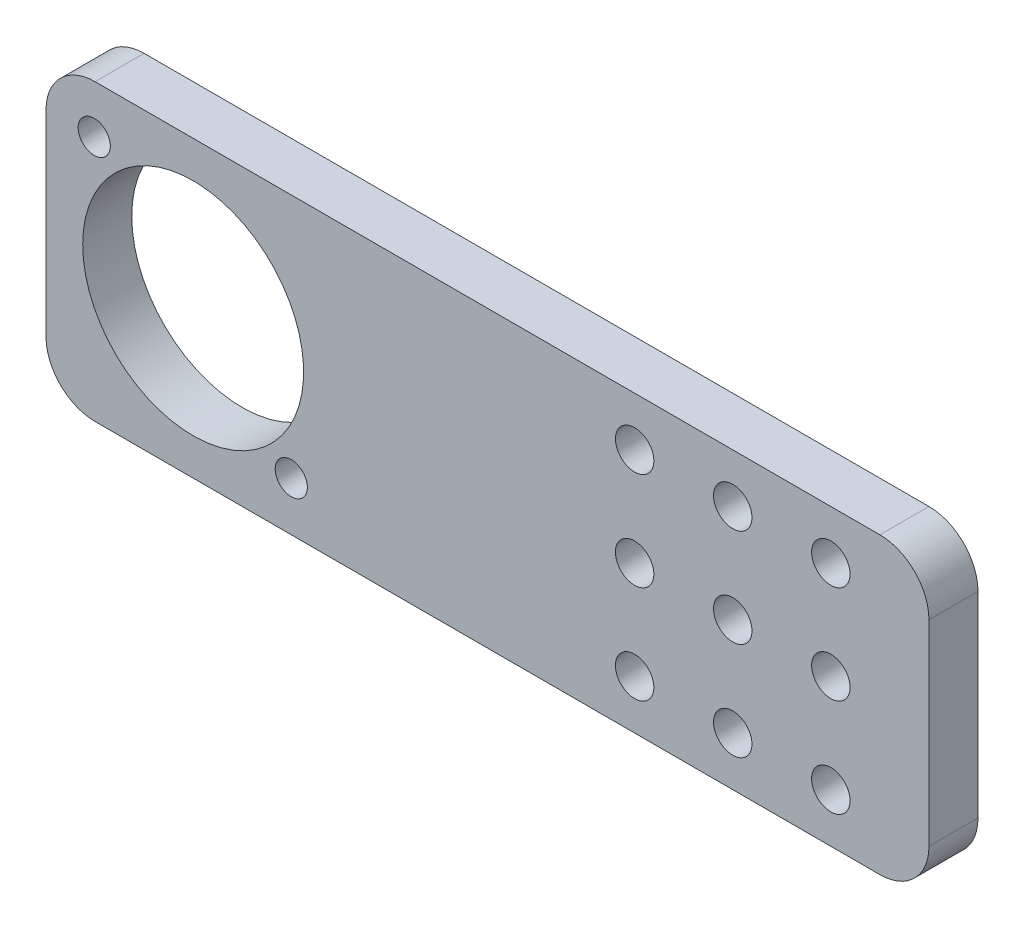
ISO-10303-21;
HEADER;
FILE_DESCRIPTION(('STEP AP214'),'2;1');
FILE_NAME('part.step','',(''),(''),'','','');
FILE_SCHEMA(('AUTOMOTIVE_DESIGN { 1 0 10303 214 1 1 1 1 }'));
ENDSEC;
DATA;
#1=APPLICATION_CONTEXT('core data for automotive mechanical design processes');
#2=APPLICATION_PROTOCOL_DEFINITION('international standard','automotive_design',2000,#1);
#3=PRODUCT_CONTEXT('',#1,'mechanical');
#4=PRODUCT('Part','Part','',(#3));
#5=PRODUCT_RELATED_PRODUCT_CATEGORY('part','',(#4));
#6=PRODUCT_DEFINITION_FORMATION('','',#4);
#7=PRODUCT_DEFINITION_CONTEXT('part definition',#1,'design');
#8=PRODUCT_DEFINITION('design','',#6,#7);
#9=PRODUCT_DEFINITION_SHAPE('','',#8);
#10=(LENGTH_UNIT() NAMED_UNIT(*) SI_UNIT(.MILLI.,.METRE.));
#11=(NAMED_UNIT(*) PLANE_ANGLE_UNIT() SI_UNIT($,.RADIAN.));
#12=(NAMED_UNIT(*) SI_UNIT($,.STERADIAN.) SOLID_ANGLE_UNIT());
#13=UNCERTAINTY_MEASURE_WITH_UNIT(LENGTH_MEASURE(1.E-05),#10,'distance_accuracy_value','');
#14=(GEOMETRIC_REPRESENTATION_CONTEXT(3) GLOBAL_UNCERTAINTY_ASSIGNED_CONTEXT((#13)) GLOBAL_UNIT_ASSIGNED_CONTEXT((#10,
#11,#12)) REPRESENTATION_CONTEXT('',''));
#15=CARTESIAN_POINT('',(0.,0.,0.));
#16=DIRECTION('',(0.,0.,1.));
#17=DIRECTION('',(1.,0.,0.));
#18=AXIS2_PLACEMENT_3D('',#15,#16,#17);
#19=CARTESIAN_POINT('',(107.95,-12.7,-6.35000000000001));
#20=DIRECTION('',(0.,0.,1.));
#21=DIRECTION('',(1.,0.,0.));
#22=AXIS2_PLACEMENT_3D('',#19,#20,#21);
#23=CYLINDRICAL_SURFACE('',#22,6.34999999999986);
#24=CARTESIAN_POINT('',(107.95,-12.7,0.));
#25=DIRECTION('',(0.,0.,1.));
#26=DIRECTION('',(1.,0.,0.));
#27=AXIS2_PLACEMENT_3D('',#24,#25,#26);
#28=CIRCLE('',#27,6.34999999999986);
#29=CARTESIAN_POINT('',(107.95,-19.0499999999999,0.));
#30=VERTEX_POINT('',#29);
#31=CARTESIAN_POINT('',(114.3,-12.7,0.));
#32=VERTEX_POINT('',#31);
#33=EDGE_CURVE('E140',#30,#32,#28,.T.);
#34=ORIENTED_EDGE('',*,*,#33,.F.);
#35=DIRECTION('',(0.,0.,1.));
#36=VECTOR('',#35,1.);
#37=CARTESIAN_POINT('',(107.95,-19.0499999999999,-6.35000000000001));
#38=LINE('',#37,#36);
#39=CARTESIAN_POINT('',(107.95,-19.0499999999999,-6.35000000000001));
#40=VERTEX_POINT('',#39);
#41=EDGE_CURVE('E11',#40,#30,#38,.T.);
#42=ORIENTED_EDGE('',*,*,#41,.F.);
#43=CARTESIAN_POINT('',(107.95,-12.7,-6.35000000000001));
#44=DIRECTION('',(0.,0.,1.));
#45=DIRECTION('',(1.,0.,0.));
#46=AXIS2_PLACEMENT_3D('',#43,#44,#45);
#47=CIRCLE('',#46,6.34999999999986);
#48=CARTESIAN_POINT('',(114.3,-12.7,-6.35000000000001));
#49=VERTEX_POINT('',#48);
#50=EDGE_CURVE('E161',#40,#49,#47,.T.);
#51=ORIENTED_EDGE('',*,*,#50,.T.);
#52=DIRECTION('',(0.,0.,1.));
#53=VECTOR('',#52,1.);
#54=CARTESIAN_POINT('',(114.3,-12.7,-6.35000000000001));
#55=LINE('',#54,#53);
#56=EDGE_CURVE('E46',#49,#32,#55,.T.);
#57=ORIENTED_EDGE('',*,*,#56,.T.);
#58=EDGE_LOOP('',(#34,#42,#51,#57));
#59=FACE_BOUND('',#58,.T.);
#60=ADVANCED_FACE('F43',(#59),#23,.T.);
#61=CARTESIAN_POINT('',(6.34999999999986,-19.0499999999999,-6.35000000000001));
#62=DIRECTION('',(0.,-1.,0.));
#63=DIRECTION('',(1.,0.,0.));
#64=AXIS2_PLACEMENT_3D('',#61,#62,#63);
#65=PLANE('',#64);
#66=DIRECTION('',(1.,0.,0.));
#67=VECTOR('',#66,1.);
#68=CARTESIAN_POINT('',(6.34999999999986,-19.0499999999999,0.));
#69=LINE('',#68,#67);
#70=CARTESIAN_POINT('',(6.34999999999986,-19.0499999999999,0.));
#71=VERTEX_POINT('',#70);
#72=EDGE_CURVE('E159',#71,#30,#69,.T.);
#73=ORIENTED_EDGE('',*,*,#72,.F.);
#74=DIRECTION('',(0.,0.,1.));
#75=VECTOR('',#74,1.);
#76=CARTESIAN_POINT('',(6.34999999999986,-19.0499999999999,-6.35000000000001));
#77=LINE('',#76,#75);
#78=CARTESIAN_POINT('',(6.34999999999986,-19.0499999999999,-6.35000000000001));
#79=VERTEX_POINT('',#78);
#80=EDGE_CURVE('E52',#79,#71,#77,.T.);
#81=ORIENTED_EDGE('',*,*,#80,.F.);
#82=DIRECTION('',(1.,0.,0.));
#83=VECTOR('',#82,1.);
#84=CARTESIAN_POINT('',(6.34999999999986,-19.0499999999999,-6.35000000000001));
#85=LINE('',#84,#83);
#86=EDGE_CURVE('E130',#79,#40,#85,.T.);
#87=ORIENTED_EDGE('',*,*,#86,.T.);
#88=ORIENTED_EDGE('',*,*,#41,.T.);
#89=EDGE_LOOP('',(#73,#81,#87,#88));
#90=FACE_BOUND('',#89,.T.);
#91=ADVANCED_FACE('F173',(#90),#65,.T.);
#92=CARTESIAN_POINT('',(6.34999999999986,-12.7,-6.35000000000001));
#93=DIRECTION('',(0.,0.,1.));
#94=DIRECTION('',(1.,0.,0.));
#95=AXIS2_PLACEMENT_3D('',#92,#93,#94);
#96=CYLINDRICAL_SURFACE('',#95,6.34999999999986);
#97=CARTESIAN_POINT('',(6.34999999999986,-12.7,0.));
#98=DIRECTION('',(0.,0.,1.));
#99=DIRECTION('',(1.,0.,0.));
#100=AXIS2_PLACEMENT_3D('',#97,#98,#99);
#101=CIRCLE('',#100,6.34999999999986);
#102=CARTESIAN_POINT('',(0.,-12.7,0.));
#103=VERTEX_POINT('',#102);
#104=EDGE_CURVE('E117',#103,#71,#101,.T.);
#105=ORIENTED_EDGE('',*,*,#104,.F.);
#106=DIRECTION('',(0.,0.,1.));
#107=VECTOR('',#106,1.);
#108=CARTESIAN_POINT('',(0.,-12.7,-6.35000000000001));
#109=LINE('',#108,#107);
#110=CARTESIAN_POINT('',(0.,-12.7,-6.35000000000001));
#111=VERTEX_POINT('',#110);
#112=EDGE_CURVE('E112',#111,#103,#109,.T.);
#113=ORIENTED_EDGE('',*,*,#112,.F.);
#114=CARTESIAN_POINT('',(6.34999999999986,-12.7,-6.35000000000001));
#115=DIRECTION('',(0.,0.,1.));
#116=DIRECTION('',(1.,0.,0.));
#117=AXIS2_PLACEMENT_3D('',#114,#115,#116);
#118=CIRCLE('',#117,6.34999999999986);
#119=EDGE_CURVE('E115',#111,#79,#118,.T.);
#120=ORIENTED_EDGE('',*,*,#119,.T.);
#121=ORIENTED_EDGE('',*,*,#80,.T.);
#122=EDGE_LOOP('',(#105,#113,#120,#121));
#123=FACE_BOUND('',#122,.T.);
#124=ADVANCED_FACE('F114',(#123),#96,.T.);
#125=CARTESIAN_POINT('',(0.,12.7,-6.35000000000001));
#126=DIRECTION('',(-1.,0.,0.));
#127=DIRECTION('',(0.,-1.,0.));
#128=AXIS2_PLACEMENT_3D('',#125,#126,#127);
#129=PLANE('',#128);
#130=DIRECTION('',(0.,-1.,0.));
#131=VECTOR('',#130,1.);
#132=CARTESIAN_POINT('',(0.,12.7,0.));
#133=LINE('',#132,#131);
#134=CARTESIAN_POINT('',(0.,12.7,0.));
#135=VERTEX_POINT('',#134);
#136=EDGE_CURVE('E156',#135,#103,#133,.T.);
#137=ORIENTED_EDGE('',*,*,#136,.F.);
#138=DIRECTION('',(0.,0.,1.));
#139=VECTOR('',#138,1.);
#140=CARTESIAN_POINT('',(0.,12.7,-6.35000000000001));
#141=LINE('',#140,#139);
#142=CARTESIAN_POINT('',(0.,12.7,-6.35000000000001));
#143=VERTEX_POINT('',#142);
#144=EDGE_CURVE('E122',#143,#135,#141,.T.);
#145=ORIENTED_EDGE('',*,*,#144,.F.);
#146=DIRECTION('',(0.,-1.,0.));
#147=VECTOR('',#146,1.);
#148=CARTESIAN_POINT('',(0.,12.7,-6.35000000000001));
#149=LINE('',#148,#147);
#150=EDGE_CURVE('E128',#143,#111,#149,.T.);
#151=ORIENTED_EDGE('',*,*,#150,.T.);
#152=ORIENTED_EDGE('',*,*,#112,.T.);
#153=EDGE_LOOP('',(#137,#145,#151,#152));
#154=FACE_BOUND('',#153,.T.);
#155=ADVANCED_FACE('F132',(#154),#129,.T.);
#156=CARTESIAN_POINT('',(6.34999999999985,12.7,-6.35000000000001));
#157=DIRECTION('',(0.,0.,1.));
#158=DIRECTION('',(1.,0.,0.));
#159=AXIS2_PLACEMENT_3D('',#156,#157,#158);
#160=CYLINDRICAL_SURFACE('',#159,6.34999999999986);
#161=CARTESIAN_POINT('',(6.34999999999985,12.7,0.));
#162=DIRECTION('',(0.,0.,1.));
#163=DIRECTION('',(1.,0.,0.));
#164=AXIS2_PLACEMENT_3D('',#161,#162,#163);
#165=CIRCLE('',#164,6.34999999999986);
#166=CARTESIAN_POINT('',(6.34999999999985,19.0499999999999,0.));
#167=VERTEX_POINT('',#166);
#168=EDGE_CURVE('E153',#167,#135,#165,.T.);
#169=ORIENTED_EDGE('',*,*,#168,.F.);
#170=DIRECTION('',(0.,0.,1.));
#171=VECTOR('',#170,1.);
#172=CARTESIAN_POINT('',(6.34999999999985,19.0499999999999,-6.35000000000001));
#173=LINE('',#172,#171);
#174=CARTESIAN_POINT('',(6.34999999999985,19.0499999999999,-6.35000000000001));
#175=VERTEX_POINT('',#174);
#176=EDGE_CURVE('E165',#175,#167,#173,.T.);
#177=ORIENTED_EDGE('',*,*,#176,.F.);
#178=CARTESIAN_POINT('',(6.34999999999985,12.7,-6.35000000000001));
#179=DIRECTION('',(0.,0.,1.));
#180=DIRECTION('',(1.,0.,0.));
#181=AXIS2_PLACEMENT_3D('',#178,#179,#180);
#182=CIRCLE('',#181,6.34999999999986);
#183=EDGE_CURVE('E133',#175,#143,#182,.T.);
#184=ORIENTED_EDGE('',*,*,#183,.T.);
#185=ORIENTED_EDGE('',*,*,#144,.T.);
#186=EDGE_LOOP('',(#169,#177,#184,#185));
#187=FACE_BOUND('',#186,.T.);
#188=ADVANCED_FACE('F186',(#187),#160,.T.);
#189=CARTESIAN_POINT('',(107.95,19.05,-6.35000000000001));
#190=DIRECTION('',(0.,1.,0.));
#191=DIRECTION('',(-1.,0.,0.));
#192=AXIS2_PLACEMENT_3D('',#189,#190,#191);
#193=PLANE('',#192);
#194=DIRECTION('',(-1.,0.,0.));
#195=VECTOR('',#194,1.);
#196=CARTESIAN_POINT('',(107.95,19.05,0.));
#197=LINE('',#196,#195);
#198=CARTESIAN_POINT('',(107.95,19.05,0.));
#199=VERTEX_POINT('',#198);
#200=EDGE_CURVE('E150',#199,#167,#197,.T.);
#201=ORIENTED_EDGE('',*,*,#200,.F.);
#202=DIRECTION('',(0.,0.,1.));
#203=VECTOR('',#202,1.);
#204=CARTESIAN_POINT('',(107.95,19.05,-6.35000000000001));
#205=LINE('',#204,#203);
#206=CARTESIAN_POINT('',(107.95,19.05,-6.35000000000001));
#207=VERTEX_POINT('',#206);
#208=EDGE_CURVE('E167',#207,#199,#205,.T.);
#209=ORIENTED_EDGE('',*,*,#208,.F.);
#210=DIRECTION('',(-1.,0.,0.));
#211=VECTOR('',#210,1.);
#212=CARTESIAN_POINT('',(107.95,19.05,-6.35000000000001));
#213=LINE('',#212,#211);
#214=EDGE_CURVE('E135',#207,#175,#213,.T.);
#215=ORIENTED_EDGE('',*,*,#214,.T.);
#216=ORIENTED_EDGE('',*,*,#176,.T.);
#217=EDGE_LOOP('',(#201,#209,#215,#216));
#218=FACE_BOUND('',#217,.T.);
#219=ADVANCED_FACE('F189',(#218),#193,.T.);
#220=CARTESIAN_POINT('',(107.95,12.7000000000001,-6.35000000000001));
#221=DIRECTION('',(0.,0.,1.));
#222=DIRECTION('',(1.,0.,0.));
#223=AXIS2_PLACEMENT_3D('',#220,#221,#222);
#224=CYLINDRICAL_SURFACE('',#223,6.34999999999986);
#225=CARTESIAN_POINT('',(107.95,12.7000000000001,0.));
#226=DIRECTION('',(0.,0.,1.));
#227=DIRECTION('',(1.,0.,0.));
#228=AXIS2_PLACEMENT_3D('',#225,#226,#227);
#229=CIRCLE('',#228,6.34999999999986);
#230=CARTESIAN_POINT('',(114.3,12.7000000000001,0.));
#231=VERTEX_POINT('',#230);
#232=EDGE_CURVE('E147',#231,#199,#229,.T.);
#233=ORIENTED_EDGE('',*,*,#232,.F.);
#234=DIRECTION('',(0.,0.,1.));
#235=VECTOR('',#234,1.);
#236=CARTESIAN_POINT('',(114.3,12.7000000000001,-6.35000000000001));
#237=LINE('',#236,#235);
#238=CARTESIAN_POINT('',(114.3,12.7000000000001,-6.35000000000001));
#239=VERTEX_POINT('',#238);
#240=EDGE_CURVE('E168',#239,#231,#237,.T.);
#241=ORIENTED_EDGE('',*,*,#240,.F.);
#242=CARTESIAN_POINT('',(107.95,12.7000000000001,-6.35000000000001));
#243=DIRECTION('',(0.,0.,1.));
#244=DIRECTION('',(1.,0.,0.));
#245=AXIS2_PLACEMENT_3D('',#242,#243,#244);
#246=CIRCLE('',#245,6.34999999999986);
#247=EDGE_CURVE('E335',#239,#207,#246,.T.);
#248=ORIENTED_EDGE('',*,*,#247,.T.);
#249=ORIENTED_EDGE('',*,*,#208,.T.);
#250=EDGE_LOOP('',(#233,#241,#248,#249));
#251=FACE_BOUND('',#250,.T.);
#252=ADVANCED_FACE('F193',(#251),#224,.T.);
#253=CARTESIAN_POINT('',(114.3,-12.7,-6.35000000000001));
#254=DIRECTION('',(1.,0.,0.));
#255=DIRECTION('',(0.,1.,0.));
#256=AXIS2_PLACEMENT_3D('',#253,#254,#255);
#257=PLANE('',#256);
#258=DIRECTION('',(0.,1.,0.));
#259=VECTOR('',#258,1.);
#260=CARTESIAN_POINT('',(114.3,-12.7,0.));
#261=LINE('',#260,#259);
#262=EDGE_CURVE('E143',#32,#231,#261,.T.);
#263=ORIENTED_EDGE('',*,*,#262,.F.);
#264=ORIENTED_EDGE('',*,*,#56,.F.);
#265=DIRECTION('',(0.,1.,0.));
#266=VECTOR('',#265,1.);
#267=CARTESIAN_POINT('',(114.3,-12.7,-6.35000000000001));
#268=LINE('',#267,#266);
#269=EDGE_CURVE('E333',#49,#239,#268,.T.);
#270=ORIENTED_EDGE('',*,*,#269,.T.);
#271=ORIENTED_EDGE('',*,*,#240,.T.);
#272=EDGE_LOOP('',(#263,#264,#270,#271));
#273=FACE_BOUND('',#272,.T.);
#274=ADVANCED_FACE('F170',(#273),#257,.T.);
#275=CARTESIAN_POINT('',(107.95,-12.7,-6.35000000000001));
#276=DIRECTION('',(0.,0.,1.));
#277=DIRECTION('',(1.,0.,0.));
#278=AXIS2_PLACEMENT_3D('',#275,#276,#277);
#279=PLANE('',#278);
#280=CARTESIAN_POINT('',(76.2,-12.7,-6.35000000000001));
#281=DIRECTION('',(0.,0.,1.));
#282=DIRECTION('',(-1.,0.,0.));
#283=AXIS2_PLACEMENT_3D('',#280,#281,#282);
#284=CIRCLE('',#283,2.4892);
#285=CARTESIAN_POINT('',(73.7108,-12.7,-6.35000000000001));
#286=VERTEX_POINT('',#285);
#287=EDGE_CURVE('E260',#286,#286,#284,.T.);
#288=ORIENTED_EDGE('',*,*,#287,.T.);
#289=EDGE_LOOP('',(#288));
#290=FACE_BOUND('',#289,.T.);
#291=CARTESIAN_POINT('',(76.2,0.,-6.35000000000001));
#292=DIRECTION('',(0.,0.,1.));
#293=DIRECTION('',(-1.,0.,0.));
#294=AXIS2_PLACEMENT_3D('',#291,#292,#293);
#295=CIRCLE('',#294,2.48920000000002);
#296=CARTESIAN_POINT('',(73.7108,0.,-6.35000000000001));
#297=VERTEX_POINT('',#296);
#298=EDGE_CURVE('E268',#297,#297,#295,.T.);
#299=ORIENTED_EDGE('',*,*,#298,.T.);
#300=EDGE_LOOP('',(#299));
#301=FACE_BOUND('',#300,.T.);
#302=CARTESIAN_POINT('',(101.6,-12.7,-6.35000000000001));
#303=DIRECTION('',(0.,0.,1.));
#304=DIRECTION('',(-1.,0.,0.));
#305=AXIS2_PLACEMENT_3D('',#302,#303,#304);
#306=CIRCLE('',#305,2.4892);
#307=CARTESIAN_POINT('',(99.1108,-12.7,-6.35000000000001));
#308=VERTEX_POINT('',#307);
#309=EDGE_CURVE('E274',#308,#308,#306,.T.);
#310=ORIENTED_EDGE('',*,*,#309,.T.);
#311=EDGE_LOOP('',(#310));
#312=FACE_BOUND('',#311,.T.);
#313=CARTESIAN_POINT('',(88.9,-12.7,-6.35000000000001));
#314=DIRECTION('',(0.,0.,1.));
#315=DIRECTION('',(-1.,0.,0.));
#316=AXIS2_PLACEMENT_3D('',#313,#314,#315);
#317=CIRCLE('',#316,2.4892);
#318=CARTESIAN_POINT('',(86.4108,-12.7,-6.35000000000001));
#319=VERTEX_POINT('',#318);
#320=EDGE_CURVE('E280',#319,#319,#317,.T.);
#321=ORIENTED_EDGE('',*,*,#320,.T.);
#322=EDGE_LOOP('',(#321));
#323=FACE_BOUND('',#322,.T.);
#324=CARTESIAN_POINT('',(76.2,12.7,-6.35000000000001));
#325=DIRECTION('',(0.,0.,1.));
#326=DIRECTION('',(-1.,0.,0.));
#327=AXIS2_PLACEMENT_3D('',#324,#325,#326);
#328=CIRCLE('',#327,2.4892);
#329=CARTESIAN_POINT('',(73.7108,12.7,-6.35000000000001));
#330=VERTEX_POINT('',#329);
#331=EDGE_CURVE('E286',#330,#330,#328,.T.);
#332=ORIENTED_EDGE('',*,*,#331,.T.);
#333=EDGE_LOOP('',(#332));
#334=FACE_BOUND('',#333,.T.);
#335=CARTESIAN_POINT('',(101.6,0.,-6.35000000000001));
#336=DIRECTION('',(0.,0.,1.));
#337=DIRECTION('',(-1.,0.,0.));
#338=AXIS2_PLACEMENT_3D('',#335,#336,#337);
#339=CIRCLE('',#338,2.48920000000006);
#340=CARTESIAN_POINT('',(99.1107999999999,0.,-6.35000000000001));
#341=VERTEX_POINT('',#340);
#342=EDGE_CURVE('E292',#341,#341,#339,.T.);
#343=ORIENTED_EDGE('',*,*,#342,.T.);
#344=EDGE_LOOP('',(#343));
#345=FACE_BOUND('',#344,.T.);
#346=CARTESIAN_POINT('',(88.9,0.,-6.35000000000001));
#347=DIRECTION('',(0.,0.,1.));
#348=DIRECTION('',(-1.,0.,0.));
#349=AXIS2_PLACEMENT_3D('',#346,#347,#348);
#350=CIRCLE('',#349,2.4892);
#351=CARTESIAN_POINT('',(86.4108,0.,-6.35000000000001));
#352=VERTEX_POINT('',#351);
#353=EDGE_CURVE('E298',#352,#352,#350,.T.);
#354=ORIENTED_EDGE('',*,*,#353,.T.);
#355=EDGE_LOOP('',(#354));
#356=FACE_BOUND('',#355,.T.);
#357=CARTESIAN_POINT('',(101.6,12.7,-6.35000000000001));
#358=DIRECTION('',(0.,0.,1.));
#359=DIRECTION('',(-1.,0.,0.));
#360=AXIS2_PLACEMENT_3D('',#357,#358,#359);
#361=CIRCLE('',#360,2.4892);
#362=CARTESIAN_POINT('',(99.1108,12.7,-6.35000000000001));
#363=VERTEX_POINT('',#362);
#364=EDGE_CURVE('E304',#363,#363,#361,.T.);
#365=ORIENTED_EDGE('',*,*,#364,.T.);
#366=EDGE_LOOP('',(#365));
#367=FACE_BOUND('',#366,.T.);
#368=CARTESIAN_POINT('',(88.9,12.7,-6.35000000000001));
#369=DIRECTION('',(0.,0.,1.));
#370=DIRECTION('',(-1.,0.,0.));
#371=AXIS2_PLACEMENT_3D('',#368,#369,#370);
#372=CIRCLE('',#371,2.4892);
#373=CARTESIAN_POINT('',(86.4108,12.7,-6.35000000000001));
#374=VERTEX_POINT('',#373);
#375=EDGE_CURVE('E310',#374,#374,#372,.T.);
#376=ORIENTED_EDGE('',*,*,#375,.T.);
#377=EDGE_LOOP('',(#376));
#378=FACE_BOUND('',#377,.T.);
#379=CARTESIAN_POINT('',(31.7499999999998,-12.7,-6.35000000000001));
#380=DIRECTION('',(0.,0.,1.));
#381=DIRECTION('',(-1.,0.,0.));
#382=AXIS2_PLACEMENT_3D('',#379,#380,#381);
#383=CIRCLE('',#382,2.08279999999999);
#384=CARTESIAN_POINT('',(29.6671999999998,-12.7,-6.35000000000001));
#385=VERTEX_POINT('',#384);
#386=EDGE_CURVE('E316',#385,#385,#383,.T.);
#387=ORIENTED_EDGE('',*,*,#386,.T.);
#388=EDGE_LOOP('',(#387));
#389=FACE_BOUND('',#388,.T.);
#390=CARTESIAN_POINT('',(6.24415477135522,12.805845228644,-6.35000000000001));
#391=DIRECTION('',(0.,0.,1.));
#392=DIRECTION('',(-1.,0.,0.));
#393=AXIS2_PLACEMENT_3D('',#390,#391,#392);
#394=CIRCLE('',#393,2.0828);
#395=CARTESIAN_POINT('',(4.16135477135522,12.805845228644,-6.35000000000001));
#396=VERTEX_POINT('',#395);
#397=EDGE_CURVE('E322',#396,#396,#394,.T.);
#398=ORIENTED_EDGE('',*,*,#397,.T.);
#399=EDGE_LOOP('',(#398));
#400=FACE_BOUND('',#399,.T.);
#401=CARTESIAN_POINT('',(19.0499999999998,0.,-6.35000000000001));
#402=DIRECTION('',(0.,0.,1.));
#403=DIRECTION('',(-1.,0.,0.));
#404=AXIS2_PLACEMENT_3D('',#401,#402,#403);
#405=CIRCLE('',#404,14.3002);
#406=CARTESIAN_POINT('',(4.74979999999983,0.,-6.35000000000001));
#407=VERTEX_POINT('',#406);
#408=EDGE_CURVE('E144',#407,#407,#405,.T.);
#409=ORIENTED_EDGE('',*,*,#408,.T.);
#410=EDGE_LOOP('',(#409));
#411=FACE_BOUND('',#410,.T.);
#412=ORIENTED_EDGE('',*,*,#50,.F.);
#413=ORIENTED_EDGE('',*,*,#86,.F.);
#414=ORIENTED_EDGE('',*,*,#119,.F.);
#415=ORIENTED_EDGE('',*,*,#150,.F.);
#416=ORIENTED_EDGE('',*,*,#183,.F.);
#417=ORIENTED_EDGE('',*,*,#214,.F.);
#418=ORIENTED_EDGE('',*,*,#247,.F.);
#419=ORIENTED_EDGE('',*,*,#269,.F.);
#420=EDGE_LOOP('',(#412,#413,#414,#415,#416,#417,#418,#419));
#421=FACE_BOUND('',#420,.T.);
#422=ADVANCED_FACE('F126',(#290,#301,#312,#323,#334,#345,#356,#367,#378,#389,#400,#411,#421),
#279,.F.);
#423=CARTESIAN_POINT('',(107.95,-12.7,0.));
#424=DIRECTION('',(0.,0.,1.));
#425=DIRECTION('',(1.,0.,0.));
#426=AXIS2_PLACEMENT_3D('',#423,#424,#425);
#427=PLANE('',#426);
#428=CARTESIAN_POINT('',(76.2,-12.7,0.));
#429=DIRECTION('',(0.,0.,1.));
#430=DIRECTION('',(-1.,0.,0.));
#431=AXIS2_PLACEMENT_3D('',#428,#429,#430);
#432=CIRCLE('',#431,2.4892);
#433=CARTESIAN_POINT('',(73.7108,-12.7,0.));
#434=VERTEX_POINT('',#433);
#435=EDGE_CURVE('E263',#434,#434,#432,.T.);
#436=ORIENTED_EDGE('',*,*,#435,.F.);
#437=EDGE_LOOP('',(#436));
#438=FACE_BOUND('',#437,.T.);
#439=CARTESIAN_POINT('',(76.2,0.,0.));
#440=DIRECTION('',(0.,0.,1.));
#441=DIRECTION('',(-1.,0.,0.));
#442=AXIS2_PLACEMENT_3D('',#439,#440,#441);
#443=CIRCLE('',#442,2.48920000000002);
#444=CARTESIAN_POINT('',(73.7108,0.,0.));
#445=VERTEX_POINT('',#444);
#446=EDGE_CURVE('E265',#445,#445,#443,.T.);
#447=ORIENTED_EDGE('',*,*,#446,.F.);
#448=EDGE_LOOP('',(#447));
#449=FACE_BOUND('',#448,.T.);
#450=CARTESIAN_POINT('',(101.6,-12.7,0.));
#451=DIRECTION('',(0.,0.,1.));
#452=DIRECTION('',(-1.,0.,0.));
#453=AXIS2_PLACEMENT_3D('',#450,#451,#452);
#454=CIRCLE('',#453,2.4892);
#455=CARTESIAN_POINT('',(99.1108,-12.7,0.));
#456=VERTEX_POINT('',#455);
#457=EDGE_CURVE('E271',#456,#456,#454,.T.);
#458=ORIENTED_EDGE('',*,*,#457,.F.);
#459=EDGE_LOOP('',(#458));
#460=FACE_BOUND('',#459,.T.);
#461=CARTESIAN_POINT('',(88.9,-12.7,0.));
#462=DIRECTION('',(0.,0.,1.));
#463=DIRECTION('',(-1.,0.,0.));
#464=AXIS2_PLACEMENT_3D('',#461,#462,#463);
#465=CIRCLE('',#464,2.4892);
#466=CARTESIAN_POINT('',(86.4108,-12.7,0.));
#467=VERTEX_POINT('',#466);
#468=EDGE_CURVE('E277',#467,#467,#465,.T.);
#469=ORIENTED_EDGE('',*,*,#468,.F.);
#470=EDGE_LOOP('',(#469));
#471=FACE_BOUND('',#470,.T.);
#472=CARTESIAN_POINT('',(76.2,12.7,0.));
#473=DIRECTION('',(0.,0.,1.));
#474=DIRECTION('',(-1.,0.,0.));
#475=AXIS2_PLACEMENT_3D('',#472,#473,#474);
#476=CIRCLE('',#475,2.4892);
#477=CARTESIAN_POINT('',(73.7108,12.7,0.));
#478=VERTEX_POINT('',#477);
#479=EDGE_CURVE('E283',#478,#478,#476,.T.);
#480=ORIENTED_EDGE('',*,*,#479,.F.);
#481=EDGE_LOOP('',(#480));
#482=FACE_BOUND('',#481,.T.);
#483=CARTESIAN_POINT('',(101.6,0.,0.));
#484=DIRECTION('',(0.,0.,1.));
#485=DIRECTION('',(-1.,0.,0.));
#486=AXIS2_PLACEMENT_3D('',#483,#484,#485);
#487=CIRCLE('',#486,2.48920000000006);
#488=CARTESIAN_POINT('',(99.1107999999999,0.,0.));
#489=VERTEX_POINT('',#488);
#490=EDGE_CURVE('E289',#489,#489,#487,.T.);
#491=ORIENTED_EDGE('',*,*,#490,.F.);
#492=EDGE_LOOP('',(#491));
#493=FACE_BOUND('',#492,.T.);
#494=CARTESIAN_POINT('',(88.9,0.,0.));
#495=DIRECTION('',(0.,0.,1.));
#496=DIRECTION('',(-1.,0.,0.));
#497=AXIS2_PLACEMENT_3D('',#494,#495,#496);
#498=CIRCLE('',#497,2.4892);
#499=CARTESIAN_POINT('',(86.4108,0.,0.));
#500=VERTEX_POINT('',#499);
#501=EDGE_CURVE('E295',#500,#500,#498,.T.);
#502=ORIENTED_EDGE('',*,*,#501,.F.);
#503=EDGE_LOOP('',(#502));
#504=FACE_BOUND('',#503,.T.);
#505=CARTESIAN_POINT('',(101.6,12.7,0.));
#506=DIRECTION('',(0.,0.,1.));
#507=DIRECTION('',(-1.,0.,0.));
#508=AXIS2_PLACEMENT_3D('',#505,#506,#507);
#509=CIRCLE('',#508,2.4892);
#510=CARTESIAN_POINT('',(99.1108,12.7,0.));
#511=VERTEX_POINT('',#510);
#512=EDGE_CURVE('E301',#511,#511,#509,.T.);
#513=ORIENTED_EDGE('',*,*,#512,.F.);
#514=EDGE_LOOP('',(#513));
#515=FACE_BOUND('',#514,.T.);
#516=CARTESIAN_POINT('',(88.9,12.7,0.));
#517=DIRECTION('',(0.,0.,1.));
#518=DIRECTION('',(-1.,0.,0.));
#519=AXIS2_PLACEMENT_3D('',#516,#517,#518);
#520=CIRCLE('',#519,2.4892);
#521=CARTESIAN_POINT('',(86.4108,12.7,0.));
#522=VERTEX_POINT('',#521);
#523=EDGE_CURVE('E307',#522,#522,#520,.T.);
#524=ORIENTED_EDGE('',*,*,#523,.F.);
#525=EDGE_LOOP('',(#524));
#526=FACE_BOUND('',#525,.T.);
#527=CARTESIAN_POINT('',(31.7499999999998,-12.7,0.));
#528=DIRECTION('',(0.,0.,1.));
#529=DIRECTION('',(-1.,0.,0.));
#530=AXIS2_PLACEMENT_3D('',#527,#528,#529);
#531=CIRCLE('',#530,2.08279999999999);
#532=CARTESIAN_POINT('',(29.6671999999998,-12.7,0.));
#533=VERTEX_POINT('',#532);
#534=EDGE_CURVE('E313',#533,#533,#531,.T.);
#535=ORIENTED_EDGE('',*,*,#534,.F.);
#536=EDGE_LOOP('',(#535));
#537=FACE_BOUND('',#536,.T.);
#538=CARTESIAN_POINT('',(6.24415477135522,12.805845228644,0.));
#539=DIRECTION('',(0.,0.,1.));
#540=DIRECTION('',(-1.,0.,0.));
#541=AXIS2_PLACEMENT_3D('',#538,#539,#540);
#542=CIRCLE('',#541,2.0828);
#543=CARTESIAN_POINT('',(4.16135477135522,12.805845228644,0.));
#544=VERTEX_POINT('',#543);
#545=EDGE_CURVE('E319',#544,#544,#542,.T.);
#546=ORIENTED_EDGE('',*,*,#545,.F.);
#547=EDGE_LOOP('',(#546));
#548=FACE_BOUND('',#547,.T.);
#549=CARTESIAN_POINT('',(19.0499999999998,0.,0.));
#550=DIRECTION('',(0.,0.,1.));
#551=DIRECTION('',(-1.,0.,0.));
#552=AXIS2_PLACEMENT_3D('',#549,#550,#551);
#553=CIRCLE('',#552,14.3002);
#554=CARTESIAN_POINT('',(4.74979999999983,0.,0.));
#555=VERTEX_POINT('',#554);
#556=EDGE_CURVE('E325',#555,#555,#553,.T.);
#557=ORIENTED_EDGE('',*,*,#556,.F.);
#558=EDGE_LOOP('',(#557));
#559=FACE_BOUND('',#558,.T.);
#560=ORIENTED_EDGE('',*,*,#33,.T.);
#561=ORIENTED_EDGE('',*,*,#262,.T.);
#562=ORIENTED_EDGE('',*,*,#232,.T.);
#563=ORIENTED_EDGE('',*,*,#200,.T.);
#564=ORIENTED_EDGE('',*,*,#168,.T.);
#565=ORIENTED_EDGE('',*,*,#136,.T.);
#566=ORIENTED_EDGE('',*,*,#104,.T.);
#567=ORIENTED_EDGE('',*,*,#72,.T.);
#568=EDGE_LOOP('',(#560,#561,#562,#563,#564,#565,#566,#567));
#569=FACE_BOUND('',#568,.T.);
#570=ADVANCED_FACE('F172',(#438,#449,#460,#471,#482,#493,#504,#515,#526,#537,#548,#559,#569),
#427,.T.);
#571=CARTESIAN_POINT('',(19.0499999999998,0.,-6.35000000000001));
#572=DIRECTION('',(0.,0.,1.));
#573=DIRECTION('',(1.,0.,0.));
#574=AXIS2_PLACEMENT_3D('',#571,#572,#573);
#575=CYLINDRICAL_SURFACE('',#574,14.3002);
#576=ORIENTED_EDGE('',*,*,#408,.F.);
#577=EDGE_LOOP('',(#576));
#578=FACE_BOUND('',#577,.T.);
#579=ORIENTED_EDGE('',*,*,#556,.T.);
#580=EDGE_LOOP('',(#579));
#581=FACE_BOUND('',#580,.T.);
#582=ADVANCED_FACE('F205',(#578,#581),#575,.F.);
#583=CARTESIAN_POINT('',(6.24415477135522,12.805845228644,-6.35000000000001));
#584=DIRECTION('',(0.,0.,1.));
#585=DIRECTION('',(1.,0.,0.));
#586=AXIS2_PLACEMENT_3D('',#583,#584,#585);
#587=CYLINDRICAL_SURFACE('',#586,2.0828);
#588=ORIENTED_EDGE('',*,*,#397,.F.);
#589=EDGE_LOOP('',(#588));
#590=FACE_BOUND('',#589,.T.);
#591=ORIENTED_EDGE('',*,*,#545,.T.);
#592=EDGE_LOOP('',(#591));
#593=FACE_BOUND('',#592,.T.);
#594=ADVANCED_FACE('F212',(#590,#593),#587,.F.);
#595=CARTESIAN_POINT('',(31.7499999999998,-12.7,-6.35000000000001));
#596=DIRECTION('',(0.,0.,1.));
#597=DIRECTION('',(1.,0.,0.));
#598=AXIS2_PLACEMENT_3D('',#595,#596,#597);
#599=CYLINDRICAL_SURFACE('',#598,2.08279999999999);
#600=ORIENTED_EDGE('',*,*,#386,.F.);
#601=EDGE_LOOP('',(#600));
#602=FACE_BOUND('',#601,.T.);
#603=ORIENTED_EDGE('',*,*,#534,.T.);
#604=EDGE_LOOP('',(#603));
#605=FACE_BOUND('',#604,.T.);
#606=ADVANCED_FACE('F216',(#602,#605),#599,.F.);
#607=CARTESIAN_POINT('',(88.9,12.7,-6.35000000000001));
#608=DIRECTION('',(0.,0.,1.));
#609=DIRECTION('',(1.,0.,0.));
#610=AXIS2_PLACEMENT_3D('',#607,#608,#609);
#611=CYLINDRICAL_SURFACE('',#610,2.4892);
#612=ORIENTED_EDGE('',*,*,#375,.F.);
#613=EDGE_LOOP('',(#612));
#614=FACE_BOUND('',#613,.T.);
#615=ORIENTED_EDGE('',*,*,#523,.T.);
#616=EDGE_LOOP('',(#615));
#617=FACE_BOUND('',#616,.T.);
#618=ADVANCED_FACE('F220',(#614,#617),#611,.F.);
#619=CARTESIAN_POINT('',(101.6,12.7,-6.35000000000001));
#620=DIRECTION('',(0.,0.,1.));
#621=DIRECTION('',(1.,0.,0.));
#622=AXIS2_PLACEMENT_3D('',#619,#620,#621);
#623=CYLINDRICAL_SURFACE('',#622,2.4892);
#624=ORIENTED_EDGE('',*,*,#364,.F.);
#625=EDGE_LOOP('',(#624));
#626=FACE_BOUND('',#625,.T.);
#627=ORIENTED_EDGE('',*,*,#512,.T.);
#628=EDGE_LOOP('',(#627));
#629=FACE_BOUND('',#628,.T.);
#630=ADVANCED_FACE('F224',(#626,#629),#623,.F.);
#631=CARTESIAN_POINT('',(88.9,0.,-6.35000000000001));
#632=DIRECTION('',(0.,0.,1.));
#633=DIRECTION('',(1.,0.,0.));
#634=AXIS2_PLACEMENT_3D('',#631,#632,#633);
#635=CYLINDRICAL_SURFACE('',#634,2.4892);
#636=ORIENTED_EDGE('',*,*,#353,.F.);
#637=EDGE_LOOP('',(#636));
#638=FACE_BOUND('',#637,.T.);
#639=ORIENTED_EDGE('',*,*,#501,.T.);
#640=EDGE_LOOP('',(#639));
#641=FACE_BOUND('',#640,.T.);
#642=ADVANCED_FACE('F228',(#638,#641),#635,.F.);
#643=CARTESIAN_POINT('',(101.6,0.,-6.35000000000001));
#644=DIRECTION('',(0.,0.,1.));
#645=DIRECTION('',(1.,0.,0.));
#646=AXIS2_PLACEMENT_3D('',#643,#644,#645);
#647=CYLINDRICAL_SURFACE('',#646,2.48920000000006);
#648=ORIENTED_EDGE('',*,*,#342,.F.);
#649=EDGE_LOOP('',(#648));
#650=FACE_BOUND('',#649,.T.);
#651=ORIENTED_EDGE('',*,*,#490,.T.);
#652=EDGE_LOOP('',(#651));
#653=FACE_BOUND('',#652,.T.);
#654=ADVANCED_FACE('F232',(#650,#653),#647,.F.);
#655=CARTESIAN_POINT('',(76.2,12.7,-6.35000000000001));
#656=DIRECTION('',(0.,0.,1.));
#657=DIRECTION('',(1.,0.,0.));
#658=AXIS2_PLACEMENT_3D('',#655,#656,#657);
#659=CYLINDRICAL_SURFACE('',#658,2.4892);
#660=ORIENTED_EDGE('',*,*,#331,.F.);
#661=EDGE_LOOP('',(#660));
#662=FACE_BOUND('',#661,.T.);
#663=ORIENTED_EDGE('',*,*,#479,.T.);
#664=EDGE_LOOP('',(#663));
#665=FACE_BOUND('',#664,.T.);
#666=ADVANCED_FACE('F236',(#662,#665),#659,.F.);
#667=CARTESIAN_POINT('',(88.9,-12.7,-6.35000000000001));
#668=DIRECTION('',(0.,0.,1.));
#669=DIRECTION('',(1.,0.,0.));
#670=AXIS2_PLACEMENT_3D('',#667,#668,#669);
#671=CYLINDRICAL_SURFACE('',#670,2.4892);
#672=ORIENTED_EDGE('',*,*,#320,.F.);
#673=EDGE_LOOP('',(#672));
#674=FACE_BOUND('',#673,.T.);
#675=ORIENTED_EDGE('',*,*,#468,.T.);
#676=EDGE_LOOP('',(#675));
#677=FACE_BOUND('',#676,.T.);
#678=ADVANCED_FACE('F240',(#674,#677),#671,.F.);
#679=CARTESIAN_POINT('',(101.6,-12.7,-6.35000000000001));
#680=DIRECTION('',(0.,0.,1.));
#681=DIRECTION('',(1.,0.,0.));
#682=AXIS2_PLACEMENT_3D('',#679,#680,#681);
#683=CYLINDRICAL_SURFACE('',#682,2.4892);
#684=ORIENTED_EDGE('',*,*,#309,.F.);
#685=EDGE_LOOP('',(#684));
#686=FACE_BOUND('',#685,.T.);
#687=ORIENTED_EDGE('',*,*,#457,.T.);
#688=EDGE_LOOP('',(#687));
#689=FACE_BOUND('',#688,.T.);
#690=ADVANCED_FACE('F244',(#686,#689),#683,.F.);
#691=CARTESIAN_POINT('',(76.2,0.,-6.35000000000001));
#692=DIRECTION('',(0.,0.,1.));
#693=DIRECTION('',(1.,0.,0.));
#694=AXIS2_PLACEMENT_3D('',#691,#692,#693);
#695=CYLINDRICAL_SURFACE('',#694,2.48920000000002);
#696=ORIENTED_EDGE('',*,*,#298,.F.);
#697=EDGE_LOOP('',(#696));
#698=FACE_BOUND('',#697,.T.);
#699=ORIENTED_EDGE('',*,*,#446,.T.);
#700=EDGE_LOOP('',(#699));
#701=FACE_BOUND('',#700,.T.);
#702=ADVANCED_FACE('F248',(#698,#701),#695,.F.);
#703=CARTESIAN_POINT('',(76.2,-12.7,-6.35000000000001));
#704=DIRECTION('',(0.,0.,1.));
#705=DIRECTION('',(1.,0.,0.));
#706=AXIS2_PLACEMENT_3D('',#703,#704,#705);
#707=CYLINDRICAL_SURFACE('',#706,2.4892);
#708=ORIENTED_EDGE('',*,*,#287,.F.);
#709=EDGE_LOOP('',(#708));
#710=FACE_BOUND('',#709,.T.);
#711=ORIENTED_EDGE('',*,*,#435,.T.);
#712=EDGE_LOOP('',(#711));
#713=FACE_BOUND('',#712,.T.);
#714=ADVANCED_FACE('F252',(#710,#713),#707,.F.);
#715=CLOSED_SHELL('',(#60,#91,#124,#155,#188,#219,#252,#274,#422,#570,#582,#594,#606,#618,#630,
#642,#654,#666,#678,#690,#702,#714));
#716=MANIFOLD_SOLID_BREP('B2',#715);
#717=ADVANCED_BREP_SHAPE_REPRESENTATION('',(#18,#716),#14);
#718=SHAPE_DEFINITION_REPRESENTATION(#9,#717);
ENDSEC;
END-ISO-10303-21;
